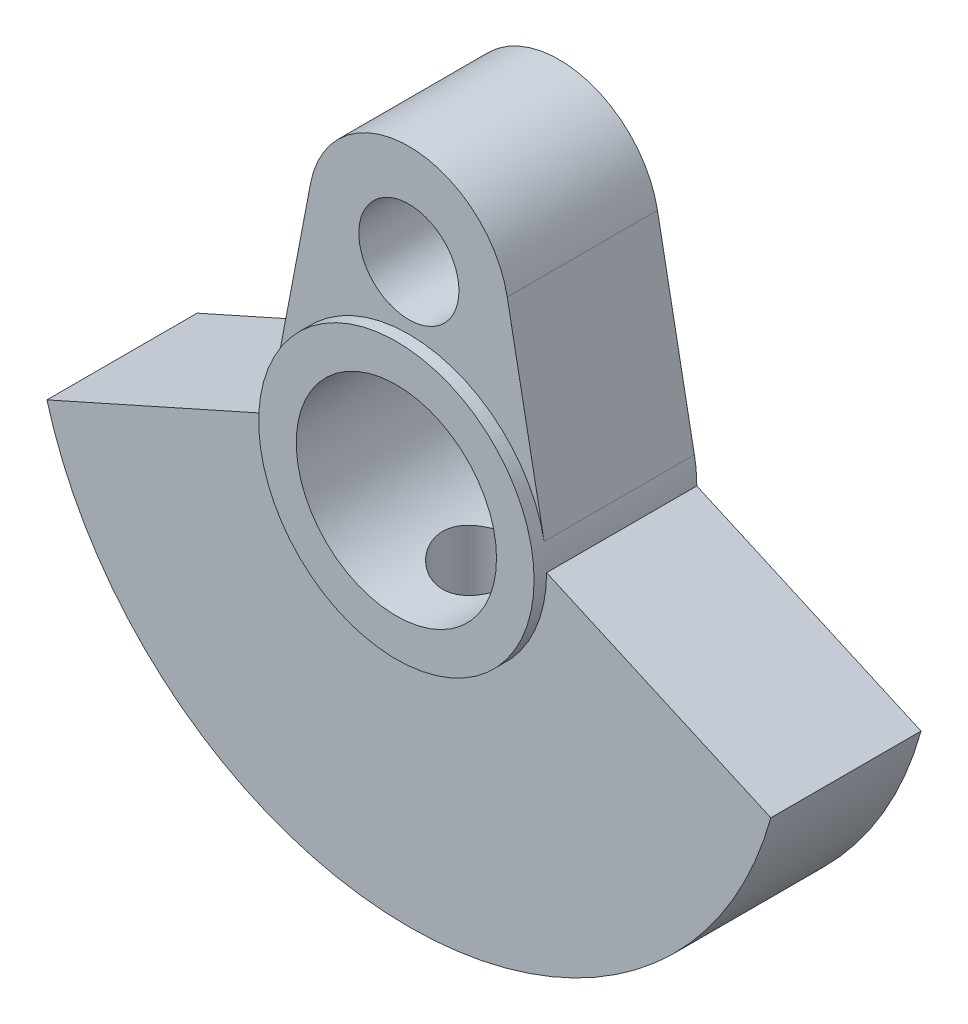
ISO-10303-21;
HEADER;
FILE_DESCRIPTION(('STEP AP214'),'2;1');
FILE_NAME('part.step','',(''),(''),'','','');
FILE_SCHEMA(('AUTOMOTIVE_DESIGN { 1 0 10303 214 1 1 1 1 }'));
ENDSEC;
DATA;
#1=APPLICATION_CONTEXT('core data for automotive mechanical design processes');
#2=APPLICATION_PROTOCOL_DEFINITION('international standard','automotive_design',2000,#1);
#3=PRODUCT_CONTEXT('',#1,'mechanical');
#4=PRODUCT('Part','Part','',(#3));
#5=PRODUCT_RELATED_PRODUCT_CATEGORY('part','',(#4));
#6=PRODUCT_DEFINITION_FORMATION('','',#4);
#7=PRODUCT_DEFINITION_CONTEXT('part definition',#1,'design');
#8=PRODUCT_DEFINITION('design','',#6,#7);
#9=PRODUCT_DEFINITION_SHAPE('','',#8);
#10=(LENGTH_UNIT() NAMED_UNIT(*) SI_UNIT(.MILLI.,.METRE.));
#11=(NAMED_UNIT(*) PLANE_ANGLE_UNIT() SI_UNIT($,.RADIAN.));
#12=(NAMED_UNIT(*) SI_UNIT($,.STERADIAN.) SOLID_ANGLE_UNIT());
#13=UNCERTAINTY_MEASURE_WITH_UNIT(LENGTH_MEASURE(1.E-05),#10,'distance_accuracy_value','');
#14=(GEOMETRIC_REPRESENTATION_CONTEXT(3) GLOBAL_UNCERTAINTY_ASSIGNED_CONTEXT((#13)) GLOBAL_UNIT_ASSIGNED_CONTEXT((#10,
#11,#12)) REPRESENTATION_CONTEXT('',''));
#15=CARTESIAN_POINT('',(0.,0.,0.));
#16=DIRECTION('',(0.,0.,1.));
#17=DIRECTION('',(1.,0.,0.));
#18=AXIS2_PLACEMENT_3D('',#15,#16,#17);
#19=CARTESIAN_POINT('',(0.,0.,3.));
#20=DIRECTION('',(0.,0.,1.));
#21=DIRECTION('',(1.,0.,0.));
#22=AXIS2_PLACEMENT_3D('',#19,#20,#21);
#23=PLANE('',#22);
#24=CARTESIAN_POINT('',(0.,0.,3.));
#25=DIRECTION('',(0.,0.,1.));
#26=DIRECTION('',(1.,0.,0.));
#27=AXIS2_PLACEMENT_3D('',#24,#25,#26);
#28=CIRCLE('',#27,5.5);
#29=CARTESIAN_POINT('',(5.40245531564121,1.03125,3.));
#30=VERTEX_POINT('',#29);
#31=CARTESIAN_POINT('',(-5.40245531564121,1.03125,3.));
#32=VERTEX_POINT('',#31);
#33=EDGE_CURVE('E11',#30,#32,#28,.T.);
#34=ORIENTED_EDGE('',*,*,#33,.F.);
#35=DIRECTION('',(-0.1875,0.982264602843857,0.));
#36=VECTOR('',#35,1.);
#37=CARTESIAN_POINT('',(3.92905841137543,8.75,3.));
#38=LINE('',#37,#36);
#39=CARTESIAN_POINT('',(3.92905841137543,8.75,3.));
#40=VERTEX_POINT('',#39);
#41=EDGE_CURVE('E157',#30,#40,#38,.T.);
#42=ORIENTED_EDGE('',*,*,#41,.T.);
#43=CARTESIAN_POINT('',(0.,8.,3.));
#44=DIRECTION('',(0.,0.,1.));
#45=DIRECTION('',(1.,0.,0.));
#46=AXIS2_PLACEMENT_3D('',#43,#44,#45);
#47=CIRCLE('',#46,4.);
#48=CARTESIAN_POINT('',(-3.92905841137543,8.75,3.));
#49=VERTEX_POINT('',#48);
#50=EDGE_CURVE('E136',#40,#49,#47,.T.);
#51=ORIENTED_EDGE('',*,*,#50,.T.);
#52=DIRECTION('',(-0.1875,-0.982264602843857,0.));
#53=VECTOR('',#52,1.);
#54=CARTESIAN_POINT('',(-3.92905841137543,8.75,3.));
#55=LINE('',#54,#53);
#56=EDGE_CURVE('E133',#49,#32,#55,.T.);
#57=ORIENTED_EDGE('',*,*,#56,.T.);
#58=EDGE_LOOP('',(#34,#42,#51,#57));
#59=FACE_BOUND('',#58,.T.);
#60=CARTESIAN_POINT('',(0.,8.,3.));
#61=DIRECTION('',(0.,0.,1.));
#62=DIRECTION('',(1.,0.,0.));
#63=AXIS2_PLACEMENT_3D('',#60,#61,#62);
#64=CIRCLE('',#63,2.);
#65=CARTESIAN_POINT('',(2.,8.,3.));
#66=VERTEX_POINT('',#65);
#67=EDGE_CURVE('E146',#66,#66,#64,.T.);
#68=ORIENTED_EDGE('',*,*,#67,.F.);
#69=EDGE_LOOP('',(#68));
#70=FACE_BOUND('',#69,.T.);
#71=ADVANCED_FACE('F33',(#59,#70),#23,.T.);
#72=CARTESIAN_POINT('',(-5.5,0.,3.));
#73=VERTEX_POINT('',#72);
#74=CARTESIAN_POINT('',(5.5,0.,3.));
#75=VERTEX_POINT('',#74);
#76=EDGE_CURVE('E48',#73,#75,#28,.T.);
#77=ORIENTED_EDGE('',*,*,#76,.F.);
#78=DIRECTION('',(-0.9130842111692,-0.40777104275993,0.));
#79=VECTOR('',#78,1.);
#80=CARTESIAN_POINT('',(-5.5,0.,3.));
#81=LINE('',#80,#79);
#82=CARTESIAN_POINT('',(-14.456832294801,-4.,3.));
#83=VERTEX_POINT('',#82);
#84=EDGE_CURVE('E114',#73,#83,#81,.T.);
#85=ORIENTED_EDGE('',*,*,#84,.T.);
#86=CARTESIAN_POINT('',(0.,0.,3.));
#87=DIRECTION('',(0.,0.,1.));
#88=DIRECTION('',(1.,0.,0.));
#89=AXIS2_PLACEMENT_3D('',#86,#87,#88);
#90=CIRCLE('',#89,15.);
#91=CARTESIAN_POINT('',(14.456832294801,-4.,3.));
#92=VERTEX_POINT('',#91);
#93=EDGE_CURVE('E57',#83,#92,#90,.T.);
#94=ORIENTED_EDGE('',*,*,#93,.T.);
#95=DIRECTION('',(-0.9130842111692,0.40777104275993,0.));
#96=VECTOR('',#95,1.);
#97=CARTESIAN_POINT('',(5.5,0.,3.));
#98=LINE('',#97,#96);
#99=EDGE_CURVE('E117',#92,#75,#98,.T.);
#100=ORIENTED_EDGE('',*,*,#99,.T.);
#101=EDGE_LOOP('',(#77,#85,#94,#100));
#102=FACE_BOUND('',#101,.T.);
#103=ADVANCED_FACE('F112',(#102),#23,.T.);
#104=CARTESIAN_POINT('',(0.,0.,-3.));
#105=DIRECTION('',(0.,0.,1.));
#106=DIRECTION('',(1.,0.,0.));
#107=AXIS2_PLACEMENT_3D('',#104,#105,#106);
#108=PLANE('',#107);
#109=CARTESIAN_POINT('',(0.,0.,-3.));
#110=DIRECTION('',(0.,0.,1.));
#111=DIRECTION('',(1.,0.,0.));
#112=AXIS2_PLACEMENT_3D('',#109,#110,#111);
#113=CIRCLE('',#112,4.);
#114=CARTESIAN_POINT('',(4.,0.,-3.));
#115=VERTEX_POINT('',#114);
#116=EDGE_CURVE('E200',#115,#115,#113,.T.);
#117=ORIENTED_EDGE('',*,*,#116,.T.);
#118=EDGE_LOOP('',(#117));
#119=FACE_BOUND('',#118,.T.);
#120=CARTESIAN_POINT('',(0.,0.,-3.));
#121=DIRECTION('',(0.,0.,1.));
#122=DIRECTION('',(1.,0.,0.));
#123=AXIS2_PLACEMENT_3D('',#120,#121,#122);
#124=CIRCLE('',#123,5.5);
#125=CARTESIAN_POINT('',(5.5,0.,-3.));
#126=VERTEX_POINT('',#125);
#127=CARTESIAN_POINT('',(5.40245531564121,1.03125,-3.));
#128=VERTEX_POINT('',#127);
#129=EDGE_CURVE('E142',#126,#128,#124,.T.);
#130=ORIENTED_EDGE('',*,*,#129,.F.);
#131=DIRECTION('',(-0.9130842111692,0.40777104275993,0.));
#132=VECTOR('',#131,1.);
#133=CARTESIAN_POINT('',(5.5,0.,-3.));
#134=LINE('',#133,#132);
#135=CARTESIAN_POINT('',(14.456832294801,-4.,-3.));
#136=VERTEX_POINT('',#135);
#137=EDGE_CURVE('E93',#136,#126,#134,.T.);
#138=ORIENTED_EDGE('',*,*,#137,.F.);
#139=CARTESIAN_POINT('',(0.,0.,-3.));
#140=DIRECTION('',(0.,0.,1.));
#141=DIRECTION('',(1.,0.,0.));
#142=AXIS2_PLACEMENT_3D('',#139,#140,#141);
#143=CIRCLE('',#142,15.);
#144=CARTESIAN_POINT('',(-14.456832294801,-4.,-3.));
#145=VERTEX_POINT('',#144);
#146=EDGE_CURVE('E86',#145,#136,#143,.T.);
#147=ORIENTED_EDGE('',*,*,#146,.F.);
#148=DIRECTION('',(-0.9130842111692,-0.40777104275993,0.));
#149=VECTOR('',#148,1.);
#150=CARTESIAN_POINT('',(-5.5,0.,-3.));
#151=LINE('',#150,#149);
#152=CARTESIAN_POINT('',(-5.5,0.,-3.));
#153=VERTEX_POINT('',#152);
#154=EDGE_CURVE('E153',#153,#145,#151,.T.);
#155=ORIENTED_EDGE('',*,*,#154,.F.);
#156=CARTESIAN_POINT('',(0.,0.,-3.));
#157=DIRECTION('',(0.,0.,1.));
#158=DIRECTION('',(1.,0.,0.));
#159=AXIS2_PLACEMENT_3D('',#156,#157,#158);
#160=CIRCLE('',#159,5.5);
#161=CARTESIAN_POINT('',(-5.40245531564121,1.03125,-3.));
#162=VERTEX_POINT('',#161);
#163=EDGE_CURVE('E126',#162,#153,#160,.T.);
#164=ORIENTED_EDGE('',*,*,#163,.F.);
#165=DIRECTION('',(-0.1875,-0.982264602843857,0.));
#166=VECTOR('',#165,1.);
#167=CARTESIAN_POINT('',(-3.92905841137543,8.75,-3.));
#168=LINE('',#167,#166);
#169=CARTESIAN_POINT('',(-3.92905841137543,8.75,-3.));
#170=VERTEX_POINT('',#169);
#171=EDGE_CURVE('E150',#170,#162,#168,.T.);
#172=ORIENTED_EDGE('',*,*,#171,.F.);
#173=CARTESIAN_POINT('',(0.,8.,-3.));
#174=DIRECTION('',(0.,0.,1.));
#175=DIRECTION('',(1.,0.,0.));
#176=AXIS2_PLACEMENT_3D('',#173,#174,#175);
#177=CIRCLE('',#176,4.);
#178=CARTESIAN_POINT('',(3.92905841137543,8.75,-3.));
#179=VERTEX_POINT('',#178);
#180=EDGE_CURVE('E148',#179,#170,#177,.T.);
#181=ORIENTED_EDGE('',*,*,#180,.F.);
#182=DIRECTION('',(-0.1875,0.982264602843857,0.));
#183=VECTOR('',#182,1.);
#184=CARTESIAN_POINT('',(3.92905841137543,8.75,-3.));
#185=LINE('',#184,#183);
#186=EDGE_CURVE('E145',#128,#179,#185,.T.);
#187=ORIENTED_EDGE('',*,*,#186,.F.);
#188=EDGE_LOOP('',(#130,#138,#147,#155,#164,#172,#181,#187));
#189=FACE_BOUND('',#188,.T.);
#190=CARTESIAN_POINT('',(0.,8.,-3.));
#191=DIRECTION('',(0.,0.,1.));
#192=DIRECTION('',(1.,0.,0.));
#193=AXIS2_PLACEMENT_3D('',#190,#191,#192);
#194=CIRCLE('',#193,2.);
#195=CARTESIAN_POINT('',(2.,8.,-3.));
#196=VERTEX_POINT('',#195);
#197=EDGE_CURVE('E189',#196,#196,#194,.T.);
#198=ORIENTED_EDGE('',*,*,#197,.T.);
#199=EDGE_LOOP('',(#198));
#200=FACE_BOUND('',#199,.T.);
#201=ADVANCED_FACE('F174',(#119,#189,#200),#108,.F.);
#202=CARTESIAN_POINT('',(3.92905841137543,8.75,3.));
#203=DIRECTION('',(-0.982264602843857,-0.1875,0.));
#204=DIRECTION('',(0.1875,-0.982264602843857,0.));
#205=AXIS2_PLACEMENT_3D('',#202,#203,#204);
#206=PLANE('',#205);
#207=ORIENTED_EDGE('',*,*,#186,.T.);
#208=DIRECTION('',(0.,0.,-1.));
#209=VECTOR('',#208,1.);
#210=CARTESIAN_POINT('',(3.92905841137543,8.75,3.));
#211=LINE('',#210,#209);
#212=EDGE_CURVE('E166',#40,#179,#211,.T.);
#213=ORIENTED_EDGE('',*,*,#212,.F.);
#214=ORIENTED_EDGE('',*,*,#41,.F.);
#215=DIRECTION('',(0.,0.,-1.));
#216=VECTOR('',#215,1.);
#217=CARTESIAN_POINT('',(5.40245531564121,1.03125,3.));
#218=LINE('',#217,#216);
#219=EDGE_CURVE('E119',#30,#128,#218,.T.);
#220=ORIENTED_EDGE('',*,*,#219,.T.);
#221=EDGE_LOOP('',(#207,#213,#214,#220));
#222=FACE_BOUND('',#221,.T.);
#223=ADVANCED_FACE('F35',(#222),#206,.F.);
#224=CARTESIAN_POINT('',(0.,8.,3.));
#225=DIRECTION('',(0.,0.,-1.));
#226=DIRECTION('',(-1.,0.,0.));
#227=AXIS2_PLACEMENT_3D('',#224,#225,#226);
#228=CYLINDRICAL_SURFACE('',#227,4.);
#229=ORIENTED_EDGE('',*,*,#180,.T.);
#230=DIRECTION('',(0.,0.,-1.));
#231=VECTOR('',#230,1.);
#232=CARTESIAN_POINT('',(-3.92905841137543,8.75,3.));
#233=LINE('',#232,#231);
#234=EDGE_CURVE('E163',#49,#170,#233,.T.);
#235=ORIENTED_EDGE('',*,*,#234,.F.);
#236=ORIENTED_EDGE('',*,*,#50,.F.);
#237=ORIENTED_EDGE('',*,*,#212,.T.);
#238=EDGE_LOOP('',(#229,#235,#236,#237));
#239=FACE_BOUND('',#238,.T.);
#240=ADVANCED_FACE('F180',(#239),#228,.T.);
#241=CARTESIAN_POINT('',(-3.92905841137543,8.75,3.));
#242=DIRECTION('',(0.982264602843857,-0.1875,0.));
#243=DIRECTION('',(0.1875,0.982264602843857,0.));
#244=AXIS2_PLACEMENT_3D('',#241,#242,#243);
#245=PLANE('',#244);
#246=ORIENTED_EDGE('',*,*,#171,.T.);
#247=DIRECTION('',(0.,0.,-1.));
#248=VECTOR('',#247,1.);
#249=CARTESIAN_POINT('',(-5.40245531564121,1.03125,3.));
#250=LINE('',#249,#248);
#251=EDGE_CURVE('E129',#32,#162,#250,.T.);
#252=ORIENTED_EDGE('',*,*,#251,.F.);
#253=ORIENTED_EDGE('',*,*,#56,.F.);
#254=ORIENTED_EDGE('',*,*,#234,.T.);
#255=EDGE_LOOP('',(#246,#252,#253,#254));
#256=FACE_BOUND('',#255,.T.);
#257=ADVANCED_FACE('F184',(#256),#245,.F.);
#258=CARTESIAN_POINT('',(0.,0.,3.));
#259=DIRECTION('',(0.,0.,-1.));
#260=DIRECTION('',(-1.,0.,0.));
#261=AXIS2_PLACEMENT_3D('',#258,#259,#260);
#262=CYLINDRICAL_SURFACE('',#261,5.5);
#263=ORIENTED_EDGE('',*,*,#163,.T.);
#264=DIRECTION('',(0.,0.,-1.));
#265=VECTOR('',#264,1.);
#266=CARTESIAN_POINT('',(-5.5,0.,3.));
#267=LINE('',#266,#265);
#268=EDGE_CURVE('E121',#73,#153,#267,.T.);
#269=ORIENTED_EDGE('',*,*,#268,.F.);
#270=ORIENTED_EDGE('',*,*,#76,.T.);
#271=DIRECTION('',(0.,0.,-1.));
#272=VECTOR('',#271,1.);
#273=CARTESIAN_POINT('',(5.5,0.,3.));
#274=LINE('',#273,#272);
#275=EDGE_CURVE('E141',#75,#126,#274,.T.);
#276=ORIENTED_EDGE('',*,*,#275,.T.);
#277=ORIENTED_EDGE('',*,*,#129,.T.);
#278=ORIENTED_EDGE('',*,*,#219,.F.);
#279=ORIENTED_EDGE('',*,*,#33,.T.);
#280=ORIENTED_EDGE('',*,*,#251,.T.);
#281=EDGE_LOOP('',(#263,#269,#270,#276,#277,#278,#279,#280));
#282=FACE_BOUND('',#281,.T.);
#283=CARTESIAN_POINT('',(0.,0.,3.5));
#284=DIRECTION('',(0.,0.,1.));
#285=DIRECTION('',(1.,0.,0.));
#286=AXIS2_PLACEMENT_3D('',#283,#284,#285);
#287=CIRCLE('',#286,5.5);
#288=CARTESIAN_POINT('',(5.5,0.,3.5));
#289=VERTEX_POINT('',#288);
#290=EDGE_CURVE('E192',#289,#289,#287,.T.);
#291=ORIENTED_EDGE('',*,*,#290,.F.);
#292=EDGE_LOOP('',(#291));
#293=FACE_BOUND('',#292,.T.);
#294=ADVANCED_FACE('F122',(#282,#293),#262,.T.);
#295=CARTESIAN_POINT('',(-5.5,0.,3.));
#296=DIRECTION('',(0.40777104275993,-0.9130842111692,0.));
#297=DIRECTION('',(0.9130842111692,0.40777104275993,0.));
#298=AXIS2_PLACEMENT_3D('',#295,#296,#297);
#299=PLANE('',#298);
#300=ORIENTED_EDGE('',*,*,#154,.T.);
#301=DIRECTION('',(0.,0.,-1.));
#302=VECTOR('',#301,1.);
#303=CARTESIAN_POINT('',(-14.456832294801,-4.,3.));
#304=LINE('',#303,#302);
#305=EDGE_CURVE('E130',#83,#145,#304,.T.);
#306=ORIENTED_EDGE('',*,*,#305,.F.);
#307=ORIENTED_EDGE('',*,*,#84,.F.);
#308=ORIENTED_EDGE('',*,*,#268,.T.);
#309=EDGE_LOOP('',(#300,#306,#307,#308));
#310=FACE_BOUND('',#309,.T.);
#311=ADVANCED_FACE('F132',(#310),#299,.F.);
#312=CARTESIAN_POINT('',(0.,0.,3.));
#313=DIRECTION('',(0.,0.,-1.));
#314=DIRECTION('',(-1.,0.,0.));
#315=AXIS2_PLACEMENT_3D('',#312,#313,#314);
#316=CYLINDRICAL_SURFACE('',#315,15.);
#317=CARTESIAN_POINT('',(0.,-15.,1.64999999999999));
#318=CARTESIAN_POINT('',(0.0923818218581739,-14.9999988431375,1.64999602592176));
#319=CARTESIAN_POINT('',(0.184823472950828,-14.9991375118722,1.64221531734204));
#320=CARTESIAN_POINT('',(0.367140384637059,-14.9957843241747,1.61129600565167));
#321=CARTESIAN_POINT('',(0.457012763410699,-14.9932907064293,1.58814081236633));
#322=CARTESIAN_POINT('',(0.631524868732983,-14.9869542195955,1.52715786204554));
#323=CARTESIAN_POINT('',(0.716167852564643,-14.9831122005694,1.48933934752697));
#324=CARTESIAN_POINT('',(0.877887506534778,-14.9745076566348,1.40012210952093));
#325=CARTESIAN_POINT('',(0.954965599904041,-14.9697453053767,1.34872594722537));
#326=CARTESIAN_POINT('',(1.09971749291982,-14.9598099458213,1.23357486983765));
#327=CARTESIAN_POINT('',(1.16735402776654,-14.9546354302355,1.16977323615296));
#328=CARTESIAN_POINT('',(1.29098229654243,-14.9444712876292,1.03172228204051));
#329=CARTESIAN_POINT('',(1.34697347210661,-14.9394816694836,0.957472460935115));
#330=CARTESIAN_POINT('',(1.44585644392366,-14.9302371294103,0.800395883029298));
#331=CARTESIAN_POINT('',(1.4887140314528,-14.9259841384625,0.717547467720966));
#332=CARTESIAN_POINT('',(1.55989482430127,-14.9187136159983,0.545775153249478));
#333=CARTESIAN_POINT('',(1.5882184598808,-14.9156960479094,0.456851434026718));
#334=CARTESIAN_POINT('',(1.6294157216232,-14.9112520065666,0.27583568675802));
#335=CARTESIAN_POINT('',(1.6423516348485,-14.9098191204392,0.183757994705014));
#336=CARTESIAN_POINT('',(1.65259886462404,-14.908686898868,-0.00127181424992092));
#337=CARTESIAN_POINT('',(1.64991067288424,-14.908987508869,-0.0942239035415671));
#338=CARTESIAN_POINT('',(1.62903725829946,-14.9112824512349,-0.277932819066921));
#339=CARTESIAN_POINT('',(1.61092026760877,-14.9132693261476,-0.36869750429989));
#340=CARTESIAN_POINT('',(1.55980980676325,-14.9187012894236,-0.545890269227683));
#341=CARTESIAN_POINT('',(1.52681609784369,-14.9221464011908,-0.632318279296054));
#342=CARTESIAN_POINT('',(1.44681419634299,-14.9301152023445,-0.798598529596556));
#343=CARTESIAN_POINT('',(1.39977596429643,-14.9346411994129,-0.878436201939898));
#344=CARTESIAN_POINT('',(1.29304180674751,-14.944259925937,-1.02910998413143));
#345=CARTESIAN_POINT('',(1.23334543269005,-14.9493526754732,-1.0999457748458));
#346=CARTESIAN_POINT('',(1.10260955971916,-14.9595642939927,-1.23100135292739));
#347=CARTESIAN_POINT('',(1.03151117609732,-14.9646831571922,-1.291162415296));
#348=CARTESIAN_POINT('',(0.880193329427116,-14.9743446474524,-1.39870484603086));
#349=CARTESIAN_POINT('',(0.799973852605641,-14.978887273643,-1.446086195099));
#350=CARTESIAN_POINT('',(0.632648549173297,-14.9868864198642,-1.52672275506591));
#351=CARTESIAN_POINT('',(0.545541148541529,-14.9903426907391,-1.55997472600502));
#352=CARTESIAN_POINT('',(0.366932993265995,-14.9957772807096,-1.61136425628381));
#353=CARTESIAN_POINT('',(0.275432397824436,-14.9977556533188,-1.62950236288868));
#354=CARTESIAN_POINT('',(0.0911434787578448,-15.0000046359516,-1.65007418859381));
#355=CARTESIAN_POINT('',(-0.00163570174845583,-15.0002840523084,-1.65258889119218));
#356=CARTESIAN_POINT('',(-0.186294166416551,-14.9991273146614,-1.64205560627015));
#357=CARTESIAN_POINT('',(-0.278173465315143,-14.9976911887995,-1.62900787403706));
#358=CARTESIAN_POINT('',(-0.458188360559869,-14.9932703044021,-1.58778731886136));
#359=CARTESIAN_POINT('',(-0.546332803398983,-14.9902894555646,-1.5596526747105));
#360=CARTESIAN_POINT('',(-0.716651536032793,-14.9831132635213,-1.48909634060411));
#361=CARTESIAN_POINT('',(-0.798825665625386,-14.9789178877409,-1.44667426744436));
#362=CARTESIAN_POINT('',(-0.955235638443856,-14.9697593637147,-1.34854827826069));
#363=CARTESIAN_POINT('',(-1.02943811324488,-14.9647931858517,-1.2927914613703));
#364=CARTESIAN_POINT('',(-1.1674600255377,-14.9546593253991,-1.16965418632295));
#365=CARTESIAN_POINT('',(-1.23127914630014,-14.9494916366686,-1.10227337372175));
#366=CARTESIAN_POINT('',(-1.34700625191035,-14.9395104302445,-0.95744616179261));
#367=CARTESIAN_POINT('',(-1.39886088486303,-14.9346985615749,-0.879957000690625));
#368=CARTESIAN_POINT('',(-1.48881961499013,-14.9259997112416,-0.717322352078206));
#369=CARTESIAN_POINT('',(-1.52692393381705,-14.9221127146694,-0.632176988011973));
#370=CARTESIAN_POINT('',(-1.58821216984629,-14.9157144017887,-0.45682581030272));
#371=CARTESIAN_POINT('',(-1.61142720744415,-14.913200217783,-0.366630982795061));
#372=CARTESIAN_POINT('',(-1.64237859902929,-14.9098235690547,-0.183594220014752));
#373=CARTESIAN_POINT('',(-1.65011549909774,-14.9089610460603,-0.090752378248119));
#374=CARTESIAN_POINT('',(-1.64988250778875,-14.9089867901201,0.0944125396664027));
#375=CARTESIAN_POINT('',(-1.64199642382742,-14.9098657154102,0.18673573391973));
#376=CARTESIAN_POINT('',(-1.61091769726742,-14.9132553441701,0.368736786357107));
#377=CARTESIAN_POINT('',(-1.58772504262742,-14.9157660489234,0.458414642460071));
#378=CARTESIAN_POINT('',(-1.52671583943656,-14.9221336424926,0.632574813176136));
#379=CARTESIAN_POINT('',(-1.48890235332836,-14.9259902493827,0.717058211515178));
#380=CARTESIAN_POINT('',(-1.39973329169087,-14.9346156407071,0.878493138434601));
#381=CARTESIAN_POINT('',(-1.3483776993887,-14.9393844262711,0.955444657686032));
#382=CARTESIAN_POINT('',(-1.23326864168925,-14.9493275259266,1.1000607296797));
#383=CARTESIAN_POINT('',(-1.16945266430596,-14.9545038027611,1.16767539235068));
#384=CARTESIAN_POINT('',(-1.03136150958025,-14.9646609076263,1.29127092100456));
#385=CARTESIAN_POINT('',(-0.95708384630353,-14.969641688842,1.34724901402361));
#386=CARTESIAN_POINT('',(-0.799929681435434,-14.9788625057048,1.44611876670878));
#387=CARTESIAN_POINT('',(-0.717028162742393,-14.9831002847694,1.48897084583363));
#388=CARTESIAN_POINT('',(-0.545209885523748,-14.9903338724846,1.56008722850783));
#389=CARTESIAN_POINT('',(-0.456299942937418,-14.993331061833,1.58836775789974));
#390=CARTESIAN_POINT('',(-0.305751892942926,-14.9970040251543,1.62259125766416));
#391=CARTESIAN_POINT('',(-0.245071615108731,-14.9981221898992,1.6328552237871));
#392=CARTESIAN_POINT('',(-0.122936388450105,-14.9996205603388,1.64656089944539));
#393=CARTESIAN_POINT('',(-0.0614814436954419,-15.0000007699088,1.65000264480676));
#394=CARTESIAN_POINT('',(0.,-15.,1.64999999999999));
#395=B_SPLINE_CURVE_WITH_KNOTS('',3,(#317,#318,#319,#320,#321,#322,#323,#324,#325,#326,#327,
#328,#329,#330,#331,#332,#333,#334,#335,#336,#337,#338,#339,#340,#341,#342,#343,#344,#345,#346,
#347,#348,#349,#350,#351,#352,#353,#354,#355,#356,#357,#358,#359,#360,#361,#362,#363,#364,#365,
#366,#367,#368,#369,#370,#371,#372,#373,#374,#375,#376,#377,#378,#379,#380,#381,#382,#383,#384,
#385,#386,#387,#388,#389,#390,#391,#392,#393,#394),.UNSPECIFIED.,.T.,.F.,(4,2,2,2,2,2,2,2,2,2,2,
2,2,2,2,2,2,2,2,2,2,2,2,2,2,2,2,2,2,2,2,2,2,2,2,2,2,2,4),(0.,0.276920934615253,
0.554141173519897,0.831186959564194,1.10818052291128,1.38623817794143,1.66430916204826,
1.94309839229292,2.22187936884105,2.49952800190879,2.77716789707698,3.05358629881208,
3.33000913709781,3.6070274967635,3.88405567451858,4.16256356312761,4.44107187229717,
4.71964401084107,4.99820606199366,5.27532298117501,5.55243535457278,5.82884975677337,
6.10527157329621,6.38280873719028,6.6603543653718,6.93911468163527,7.21787050413383,
7.49604177805966,7.77420323770545,8.05087657749378,8.3275501349349,8.60416577239306,
8.88078175246168,9.15882288790668,9.4369302040601,9.71586805930808,9.99449463424154,
10.1787905045231,10.3630854069961),.UNSPECIFIED.);
#396=CARTESIAN_POINT('',(0.,-15.,1.64999999999999));
#397=VERTEX_POINT('',#396);
#398=EDGE_CURVE('E203',#397,#397,#395,.T.);
#399=ORIENTED_EDGE('',*,*,#398,.T.);
#400=EDGE_LOOP('',(#399));
#401=FACE_BOUND('',#400,.T.);
#402=ORIENTED_EDGE('',*,*,#146,.T.);
#403=DIRECTION('',(0.,0.,-1.));
#404=VECTOR('',#403,1.);
#405=CARTESIAN_POINT('',(14.456832294801,-4.,3.));
#406=LINE('',#405,#404);
#407=EDGE_CURVE('E159',#92,#136,#406,.T.);
#408=ORIENTED_EDGE('',*,*,#407,.F.);
#409=ORIENTED_EDGE('',*,*,#93,.F.);
#410=ORIENTED_EDGE('',*,*,#305,.T.);
#411=EDGE_LOOP('',(#402,#408,#409,#410));
#412=FACE_BOUND('',#411,.T.);
#413=ADVANCED_FACE('F209',(#401,#412),#316,.T.);
#414=CARTESIAN_POINT('',(5.5,0.,3.));
#415=DIRECTION('',(-0.40777104275993,-0.9130842111692,0.));
#416=DIRECTION('',(0.9130842111692,-0.40777104275993,0.));
#417=AXIS2_PLACEMENT_3D('',#414,#415,#416);
#418=PLANE('',#417);
#419=ORIENTED_EDGE('',*,*,#137,.T.);
#420=ORIENTED_EDGE('',*,*,#275,.F.);
#421=ORIENTED_EDGE('',*,*,#99,.F.);
#422=ORIENTED_EDGE('',*,*,#407,.T.);
#423=EDGE_LOOP('',(#419,#420,#421,#422));
#424=FACE_BOUND('',#423,.T.);
#425=ADVANCED_FACE('F230',(#424),#418,.F.);
#426=CARTESIAN_POINT('',(0.,8.,3.));
#427=DIRECTION('',(0.,0.,-1.));
#428=DIRECTION('',(-1.,0.,0.));
#429=AXIS2_PLACEMENT_3D('',#426,#427,#428);
#430=CYLINDRICAL_SURFACE('',#429,2.);
#431=ORIENTED_EDGE('',*,*,#67,.T.);
#432=EDGE_LOOP('',(#431));
#433=FACE_BOUND('',#432,.T.);
#434=ORIENTED_EDGE('',*,*,#197,.F.);
#435=EDGE_LOOP('',(#434));
#436=FACE_BOUND('',#435,.T.);
#437=ADVANCED_FACE('F226',(#433,#436),#430,.F.);
#438=CARTESIAN_POINT('',(0.,0.,3.5));
#439=DIRECTION('',(0.,0.,1.));
#440=DIRECTION('',(1.,0.,0.));
#441=AXIS2_PLACEMENT_3D('',#438,#439,#440);
#442=PLANE('',#441);
#443=ORIENTED_EDGE('',*,*,#290,.T.);
#444=EDGE_LOOP('',(#443));
#445=FACE_BOUND('',#444,.T.);
#446=CARTESIAN_POINT('',(0.,0.,3.5));
#447=DIRECTION('',(0.,0.,1.));
#448=DIRECTION('',(1.,0.,0.));
#449=AXIS2_PLACEMENT_3D('',#446,#447,#448);
#450=CIRCLE('',#449,4.);
#451=CARTESIAN_POINT('',(4.,0.,3.5));
#452=VERTEX_POINT('',#451);
#453=EDGE_CURVE('E197',#452,#452,#450,.T.);
#454=ORIENTED_EDGE('',*,*,#453,.F.);
#455=EDGE_LOOP('',(#454));
#456=FACE_BOUND('',#455,.T.);
#457=ADVANCED_FACE('F222',(#445,#456),#442,.T.);
#458=CARTESIAN_POINT('',(0.,0.,3.5));
#459=DIRECTION('',(0.,0.,-1.));
#460=DIRECTION('',(-1.,0.,0.));
#461=AXIS2_PLACEMENT_3D('',#458,#459,#460);
#462=CYLINDRICAL_SURFACE('',#461,4.);
#463=CARTESIAN_POINT('',(0.,-4.,1.64999999999999));
#464=CARTESIAN_POINT('',(0.0884596783632786,-3.99999309817074,1.64999078279336));
#465=CARTESIAN_POINT('',(0.177062252057582,-3.99703145792172,1.64284398565668));
#466=CARTESIAN_POINT('',(0.351759669836408,-3.9854711320255,1.6145088580631));
#467=CARTESIAN_POINT('',(0.437847271996959,-3.97685757767606,1.59328348897568));
#468=CARTESIAN_POINT('',(0.604702496902739,-3.95491965529936,1.5377051877981));
#469=CARTESIAN_POINT('',(0.685486934491194,-3.94161112398211,1.50339635664654));
#470=CARTESIAN_POINT('',(0.840076633223485,-3.91158286286531,1.42280524215057));
#471=CARTESIAN_POINT('',(0.913884076117563,-3.89486420463244,1.37652671882984));
#472=CARTESIAN_POINT('',(1.05618769598525,-3.85876900012149,1.27089324535595));
#473=CARTESIAN_POINT('',(1.12429373957476,-3.83930654387258,1.21104232975102));
#474=CARTESIAN_POINT('',(1.24983574384757,-3.80029483347099,1.08101116034103));
#475=CARTESIAN_POINT('',(1.30726618926957,-3.78074553976622,1.01082560078819));
#476=CARTESIAN_POINT('',(1.41254826809049,-3.74272551686067,0.858031751128285));
#477=CARTESIAN_POINT('',(1.45980781790561,-3.72435159658093,0.774988884693474));
#478=CARTESIAN_POINT('',(1.53951358199406,-3.69212136090386,0.601263690709817));
#479=CARTESIAN_POINT('',(1.5719672771279,-3.67826276509115,0.510585248636991));
#480=CARTESIAN_POINT('',(1.61953738222491,-3.65756021871623,0.328652002998169));
#481=CARTESIAN_POINT('',(1.63540371417153,-3.65041449103236,0.237628927856929));
#482=CARTESIAN_POINT('',(1.65168918120802,-3.64307714795703,0.0539534926347214));
#483=CARTESIAN_POINT('',(1.65211659474,-3.64288180572738,-0.0386979676293035));
#484=CARTESIAN_POINT('',(1.6380778077983,-3.64921138579605,-0.215598886618722));
#485=CARTESIAN_POINT('',(1.62472398487458,-3.6552343974104,-0.299958158749156));
#486=CARTESIAN_POINT('',(1.58536484231197,-3.67247532251837,-0.46511028438117));
#487=CARTESIAN_POINT('',(1.55935715587184,-3.68369420783859,-0.545902467603297));
#488=CARTESIAN_POINT('',(1.49492412942488,-3.71031458481431,-0.70364510875862));
#489=CARTESIAN_POINT('',(1.45624866973016,-3.72579923184191,-0.780478737808329));
#490=CARTESIAN_POINT('',(1.36775445443624,-3.75918616236907,-0.926860232460033));
#491=CARTESIAN_POINT('',(1.31793135478159,-3.77708938726885,-0.996405242249148));
#492=CARTESIAN_POINT('',(1.20371911924869,-3.81509742396095,-1.13228640778781));
#493=CARTESIAN_POINT('',(1.13846630094388,-3.8352618825369,-1.19788195770325));
#494=CARTESIAN_POINT('',(0.997682554866212,-3.87426910607353,-1.31744467444137));
#495=CARTESIAN_POINT('',(0.92214931984743,-3.8931115728953,-1.37140922386084));
#496=CARTESIAN_POINT('',(0.760736369737322,-3.92787932271737,-1.46723477358503));
#497=CARTESIAN_POINT('',(0.674664094072234,-3.94373050716791,-1.50880028319417));
#498=CARTESIAN_POINT('',(0.495928253552975,-3.97016319816605,-1.57660302410887));
#499=CARTESIAN_POINT('',(0.403268287372383,-3.98074755693754,-1.60284855321116));
#500=CARTESIAN_POINT('',(0.220181304317672,-3.99492450637935,-1.63772950367822));
#501=CARTESIAN_POINT('',(0.129974172308221,-3.99891121146315,-1.64735917793593));
#502=CARTESIAN_POINT('',(-0.0508474401522224,-4.00069746426785,-1.65169204376329));
#503=CARTESIAN_POINT('',(-0.141461799500566,-3.99849874371343,-1.64639941310821));
#504=CARTESIAN_POINT('',(-0.315907755487548,-3.98841747083847,-1.62175473175704));
#505=CARTESIAN_POINT('',(-0.399855317526684,-3.9808153168881,-1.6030959266599));
#506=CARTESIAN_POINT('',(-0.563340473329573,-3.96098887803091,-1.55320790366289));
#507=CARTESIAN_POINT('',(-0.642877505872145,-3.94876400644332,-1.5219770901852));
#508=CARTESIAN_POINT('',(-0.798061975964473,-3.92039728883464,-1.4468106200191));
#509=CARTESIAN_POINT('',(-0.873512656660504,-3.90414585630856,-1.40251143824378));
#510=CARTESIAN_POINT('',(-1.01617847320907,-3.86946768187548,-1.30286606574213));
#511=CARTESIAN_POINT('',(-1.0833901834211,-3.85104004134398,-1.24751530491016));
#512=CARTESIAN_POINT('',(-1.21261994292741,-3.8124029584454,-1.12279569518802));
#513=CARTESIAN_POINT('',(-1.27394364561822,-3.79215916493832,-1.0527161759607));
#514=CARTESIAN_POINT('',(-1.38414835482505,-3.75333928940831,-0.90292870939147));
#515=CARTESIAN_POINT('',(-1.43302674162727,-3.73476355904109,-0.823218740057444));
#516=CARTESIAN_POINT('',(-1.51742282291387,-3.70128700339843,-0.654904629466684));
#517=CARTESIAN_POINT('',(-1.55275802936534,-3.68643724424496,-0.566198083991941));
#518=CARTESIAN_POINT('',(-1.60769618165393,-3.66281640168181,-0.383290834021755));
#519=CARTESIAN_POINT('',(-1.62731175174752,-3.65404044124936,-0.289094603581825));
#520=CARTESIAN_POINT('',(-1.64901123940267,-3.64429559365239,-0.105569726841934));
#521=CARTESIAN_POINT('',(-1.65231049364124,-3.64278573581524,-0.0164127805420605));
#522=CARTESIAN_POINT('',(-1.64451485356567,-3.64631178238903,0.161128470759179));
#523=CARTESIAN_POINT('',(-1.63342206561729,-3.65134672892697,0.249512886919371));
#524=CARTESIAN_POINT('',(-1.59817118006571,-3.666904904187,0.418933071257697));
#525=CARTESIAN_POINT('',(-1.57461958437453,-3.67717261200251,0.50012071142211));
#526=CARTESIAN_POINT('',(-1.51570599472927,-3.70184411206584,0.657414522474083));
#527=CARTESIAN_POINT('',(-1.48034069596892,-3.71624906152171,0.733519264297609));
#528=CARTESIAN_POINT('',(-1.3963806225379,-3.7486340889516,0.883422038241396));
#529=CARTESIAN_POINT('',(-1.34712443599271,-3.76677577854003,0.956814071021407));
#530=CARTESIAN_POINT('',(-1.23771718137822,-3.80412864636709,1.09467168726428));
#531=CARTESIAN_POINT('',(-1.17756245772962,-3.82334018195057,1.15913426277442));
#532=CARTESIAN_POINT('',(-1.04300738755743,-3.86230172013188,1.28199413870367));
#533=CARTESIAN_POINT('',(-0.967900110730173,-3.88199359359226,1.33963922360552));
#534=CARTESIAN_POINT('',(-0.808343463182031,-3.91832426905579,1.44154015953871));
#535=CARTESIAN_POINT('',(-0.723889843442848,-3.9349616732268,1.48578988636589));
#536=CARTESIAN_POINT('',(-0.549414760109626,-3.96305691394126,1.55866373983474));
#537=CARTESIAN_POINT('',(-0.459513381649423,-3.97459855421812,1.58754242535854));
#538=CARTESIAN_POINT('',(-0.27571922921324,-3.99154438775475,1.62951108478514));
#539=CARTESIAN_POINT('',(-0.181839966818029,-3.99696786149576,1.64265066624544));
#540=CARTESIAN_POINT('',(-0.0584442952271959,-3.99968194626838,1.64922677033003));
#541=CARTESIAN_POINT('',(-0.0292299486703378,-4.00000228058838,1.65000304566421));
#542=CARTESIAN_POINT('',(0.,-4.,1.64999999999999));
#543=B_SPLINE_CURVE_WITH_KNOTS('',3,(#463,#464,#465,#466,#467,#468,#469,#470,#471,#472,#473,
#474,#475,#476,#477,#478,#479,#480,#481,#482,#483,#484,#485,#486,#487,#488,#489,#490,#491,#492,
#493,#494,#495,#496,#497,#498,#499,#500,#501,#502,#503,#504,#505,#506,#507,#508,#509,#510,#511,
#512,#513,#514,#515,#516,#517,#518,#519,#520,#521,#522,#523,#524,#525,#526,#527,#528,#529,#530,
#531,#532,#533,#534,#535,#536,#537,#538,#539,#540,#541,#542),.UNSPECIFIED.,.T.,.F.,(4,2,2,2,2,2,
2,2,2,2,2,2,2,2,2,2,2,2,2,2,2,2,2,2,2,2,2,2,2,2,2,2,2,2,2,2,2,2,2,4),(0.,0.265297098770619,
0.531294937906658,0.796403981498878,1.06142984766523,1.33841878994456,1.61555043582129,
1.90598404924537,2.19627075414924,2.4727764853942,2.74913395037959,3.00480633611682,
3.2605265616686,3.5216353930134,3.78284615202014,4.06565185095455,4.34852112528508,
4.63767392136374,4.92666995726766,5.19768149557684,5.46861716672804,5.72643264660553,
5.98428085748383,6.25011488704504,6.51605907418431,6.80064580250401,7.08529238632157,
7.3736498522578,7.66177550895674,7.92807823226722,8.19434198489783,8.44869772098557,
8.70312467109943,8.97267479984707,9.24231550885211,9.5310408581654,9.81989801073176,
10.1038095613048,10.3868238858898,10.4744866574818),.UNSPECIFIED.);
#544=CARTESIAN_POINT('',(0.,-4.,1.64999999999999));
#545=VERTEX_POINT('',#544);
#546=EDGE_CURVE('E37',#545,#545,#543,.T.);
#547=ORIENTED_EDGE('',*,*,#546,.F.);
#548=EDGE_LOOP('',(#547));
#549=FACE_BOUND('',#548,.T.);
#550=ORIENTED_EDGE('',*,*,#453,.T.);
#551=EDGE_LOOP('',(#550));
#552=FACE_BOUND('',#551,.T.);
#553=ORIENTED_EDGE('',*,*,#116,.F.);
#554=EDGE_LOOP('',(#553));
#555=FACE_BOUND('',#554,.T.);
#556=ADVANCED_FACE('F216',(#549,#552,#555),#462,.F.);
#557=CARTESIAN_POINT('',(0.,0.,0.));
#558=DIRECTION('',(0.,1.,0.));
#559=DIRECTION('',(0.,0.,1.));
#560=AXIS2_PLACEMENT_3D('',#557,#558,#559);
#561=CYLINDRICAL_SURFACE('',#560,1.64999999999999);
#562=ORIENTED_EDGE('',*,*,#546,.T.);
#563=EDGE_LOOP('',(#562));
#564=FACE_BOUND('',#563,.T.);
#565=ORIENTED_EDGE('',*,*,#398,.F.);
#566=EDGE_LOOP('',(#565));
#567=FACE_BOUND('',#566,.T.);
#568=ADVANCED_FACE('F213',(#564,#567),#561,.F.);
#569=CLOSED_SHELL('',(#71,#103,#201,#223,#240,#257,#294,#311,#413,#425,#437,#457,#556,#568));
#570=MANIFOLD_SOLID_BREP('B2',#569);
#571=ADVANCED_BREP_SHAPE_REPRESENTATION('',(#18,#570),#14);
#572=SHAPE_DEFINITION_REPRESENTATION(#9,#571);
ENDSEC;
END-ISO-10303-21;
